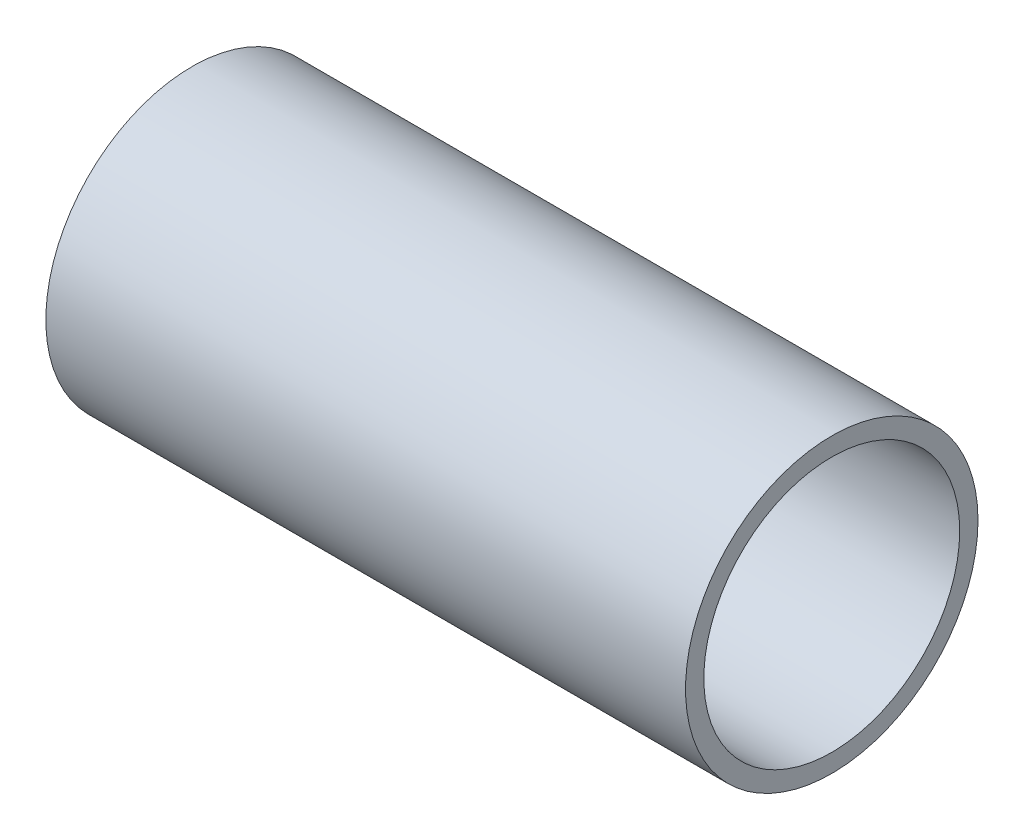
ISO-10303-21;
HEADER;
FILE_DESCRIPTION(('STEP AP214'),'2;1');
FILE_NAME('part.step','',(''),(''),'','','');
FILE_SCHEMA(('AUTOMOTIVE_DESIGN { 1 0 10303 214 1 1 1 1 }'));
ENDSEC;
DATA;
#1=APPLICATION_CONTEXT('core data for automotive mechanical design processes');
#2=APPLICATION_PROTOCOL_DEFINITION('international standard','automotive_design',2000,#1);
#3=PRODUCT_CONTEXT('',#1,'mechanical');
#4=PRODUCT('Part','Part','',(#3));
#5=PRODUCT_RELATED_PRODUCT_CATEGORY('part','',(#4));
#6=PRODUCT_DEFINITION_FORMATION('','',#4);
#7=PRODUCT_DEFINITION_CONTEXT('part definition',#1,'design');
#8=PRODUCT_DEFINITION('design','',#6,#7);
#9=PRODUCT_DEFINITION_SHAPE('','',#8);
#10=(LENGTH_UNIT() NAMED_UNIT(*) SI_UNIT(.MILLI.,.METRE.));
#11=(NAMED_UNIT(*) PLANE_ANGLE_UNIT() SI_UNIT($,.RADIAN.));
#12=(NAMED_UNIT(*) SI_UNIT($,.STERADIAN.) SOLID_ANGLE_UNIT());
#13=UNCERTAINTY_MEASURE_WITH_UNIT(LENGTH_MEASURE(1.E-05),#10,'distance_accuracy_value','');
#14=(GEOMETRIC_REPRESENTATION_CONTEXT(3) GLOBAL_UNCERTAINTY_ASSIGNED_CONTEXT((#13)) GLOBAL_UNIT_ASSIGNED_CONTEXT((#10,
#11,#12)) REPRESENTATION_CONTEXT('',''));
#15=CARTESIAN_POINT('',(0.,0.,0.));
#16=DIRECTION('',(0.,0.,1.));
#17=DIRECTION('',(1.,0.,0.));
#18=AXIS2_PLACEMENT_3D('',#15,#16,#17);
#19=CARTESIAN_POINT('',(31.75,0.,0.));
#20=DIRECTION('',(1.,0.,0.));
#21=DIRECTION('',(0.,0.,-1.));
#22=AXIS2_PLACEMENT_3D('',#19,#20,#21);
#23=PLANE('',#22);
#24=CARTESIAN_POINT('',(31.75,0.,0.));
#25=DIRECTION('',(1.,0.,0.));
#26=DIRECTION('',(0.,0.,-1.));
#27=AXIS2_PLACEMENT_3D('',#24,#25,#26);
#28=CIRCLE('',#27,14.5161);
#29=CARTESIAN_POINT('',(31.75,0.,-14.5161));
#30=VERTEX_POINT('',#29);
#31=EDGE_CURVE('E10',#30,#30,#28,.T.);
#32=ORIENTED_EDGE('',*,*,#31,.T.);
#33=EDGE_LOOP('',(#32));
#34=FACE_BOUND('',#33,.T.);
#35=CARTESIAN_POINT('',(31.75,0.,0.));
#36=DIRECTION('',(1.,0.,0.));
#37=DIRECTION('',(0.,0.,-1.));
#38=AXIS2_PLACEMENT_3D('',#35,#36,#37);
#39=CIRCLE('',#38,12.7);
#40=CARTESIAN_POINT('',(31.75,0.,-12.7));
#41=VERTEX_POINT('',#40);
#42=EDGE_CURVE('E54',#41,#41,#39,.T.);
#43=ORIENTED_EDGE('',*,*,#42,.F.);
#44=EDGE_LOOP('',(#43));
#45=FACE_BOUND('',#44,.T.);
#46=ADVANCED_FACE('F41',(#34,#45),#23,.T.);
#47=CARTESIAN_POINT('',(-31.75,0.,0.));
#48=DIRECTION('',(1.,0.,0.));
#49=DIRECTION('',(0.,0.,-1.));
#50=AXIS2_PLACEMENT_3D('',#47,#48,#49);
#51=PLANE('',#50);
#52=CARTESIAN_POINT('',(-31.75,0.,0.));
#53=DIRECTION('',(1.,0.,0.));
#54=DIRECTION('',(0.,0.,-1.));
#55=AXIS2_PLACEMENT_3D('',#52,#53,#54);
#56=CIRCLE('',#55,14.5161);
#57=CARTESIAN_POINT('',(-31.75,0.,-14.5161));
#58=VERTEX_POINT('',#57);
#59=EDGE_CURVE('E45',#58,#58,#56,.T.);
#60=ORIENTED_EDGE('',*,*,#59,.F.);
#61=EDGE_LOOP('',(#60));
#62=FACE_BOUND('',#61,.T.);
#63=CARTESIAN_POINT('',(-31.75,0.,0.));
#64=DIRECTION('',(1.,0.,0.));
#65=DIRECTION('',(0.,0.,-1.));
#66=AXIS2_PLACEMENT_3D('',#63,#64,#65);
#67=CIRCLE('',#66,12.7);
#68=CARTESIAN_POINT('',(-31.75,0.,-12.7));
#69=VERTEX_POINT('',#68);
#70=EDGE_CURVE('E56',#69,#69,#67,.T.);
#71=ORIENTED_EDGE('',*,*,#70,.T.);
#72=EDGE_LOOP('',(#71));
#73=FACE_BOUND('',#72,.T.);
#74=ADVANCED_FACE('F68',(#62,#73),#51,.F.);
#75=CARTESIAN_POINT('',(31.75,0.,0.));
#76=DIRECTION('',(-1.,0.,0.));
#77=DIRECTION('',(0.,0.,1.));
#78=AXIS2_PLACEMENT_3D('',#75,#76,#77);
#79=CYLINDRICAL_SURFACE('',#78,14.5161);
#80=ORIENTED_EDGE('',*,*,#31,.F.);
#81=EDGE_LOOP('',(#80));
#82=FACE_BOUND('',#81,.T.);
#83=ORIENTED_EDGE('',*,*,#59,.T.);
#84=EDGE_LOOP('',(#83));
#85=FACE_BOUND('',#84,.T.);
#86=ADVANCED_FACE('F43',(#82,#85),#79,.T.);
#87=CARTESIAN_POINT('',(31.75,0.,0.));
#88=DIRECTION('',(-1.,0.,0.));
#89=DIRECTION('',(0.,0.,1.));
#90=AXIS2_PLACEMENT_3D('',#87,#88,#89);
#91=CYLINDRICAL_SURFACE('',#90,12.7);
#92=ORIENTED_EDGE('',*,*,#42,.T.);
#93=EDGE_LOOP('',(#92));
#94=FACE_BOUND('',#93,.T.);
#95=ORIENTED_EDGE('',*,*,#70,.F.);
#96=EDGE_LOOP('',(#95));
#97=FACE_BOUND('',#96,.T.);
#98=ADVANCED_FACE('F64',(#94,#97),#91,.F.);
#99=CLOSED_SHELL('',(#46,#74,#86,#98));
#100=MANIFOLD_SOLID_BREP('B2',#99);
#101=ADVANCED_BREP_SHAPE_REPRESENTATION('',(#18,#100),#14);
#102=SHAPE_DEFINITION_REPRESENTATION(#9,#101);
ENDSEC;
END-ISO-10303-21;
